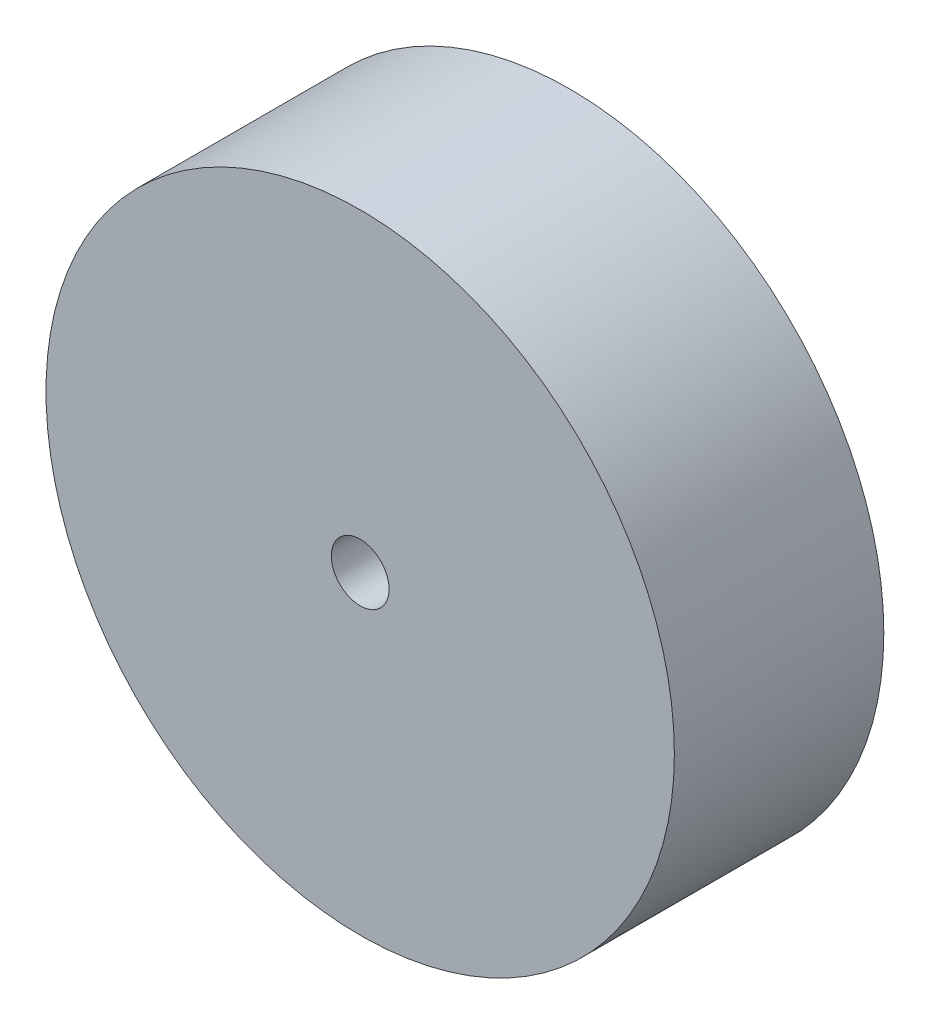
ISO-10303-21;
HEADER;
FILE_DESCRIPTION(('STEP AP214'),'2;1');
FILE_NAME('part.step','',(''),(''),'','','');
FILE_SCHEMA(('AUTOMOTIVE_DESIGN { 1 0 10303 214 1 1 1 1 }'));
ENDSEC;
DATA;
#1=APPLICATION_CONTEXT('core data for automotive mechanical design processes');
#2=APPLICATION_PROTOCOL_DEFINITION('international standard','automotive_design',2000,#1);
#3=PRODUCT_CONTEXT('',#1,'mechanical');
#4=PRODUCT('Part','Part','',(#3));
#5=PRODUCT_RELATED_PRODUCT_CATEGORY('part','',(#4));
#6=PRODUCT_DEFINITION_FORMATION('','',#4);
#7=PRODUCT_DEFINITION_CONTEXT('part definition',#1,'design');
#8=PRODUCT_DEFINITION('design','',#6,#7);
#9=PRODUCT_DEFINITION_SHAPE('','',#8);
#10=(LENGTH_UNIT() NAMED_UNIT(*) SI_UNIT(.MILLI.,.METRE.));
#11=(NAMED_UNIT(*) PLANE_ANGLE_UNIT() SI_UNIT($,.RADIAN.));
#12=(NAMED_UNIT(*) SI_UNIT($,.STERADIAN.) SOLID_ANGLE_UNIT());
#13=UNCERTAINTY_MEASURE_WITH_UNIT(LENGTH_MEASURE(1.E-05),#10,'distance_accuracy_value','');
#14=(GEOMETRIC_REPRESENTATION_CONTEXT(3) GLOBAL_UNCERTAINTY_ASSIGNED_CONTEXT((#13)) GLOBAL_UNIT_ASSIGNED_CONTEXT((#10,
#11,#12)) REPRESENTATION_CONTEXT('',''));
#15=CARTESIAN_POINT('',(0.,0.,0.));
#16=DIRECTION('',(0.,0.,1.));
#17=DIRECTION('',(1.,0.,0.));
#18=AXIS2_PLACEMENT_3D('',#15,#16,#17);
#19=CARTESIAN_POINT('',(0.,0.,12.7));
#20=DIRECTION('',(0.,0.,1.));
#21=DIRECTION('',(1.,0.,0.));
#22=AXIS2_PLACEMENT_3D('',#19,#20,#21);
#23=PLANE('',#22);
#24=CARTESIAN_POINT('',(0.,0.,12.7));
#25=DIRECTION('',(0.,0.,1.));
#26=DIRECTION('',(1.,0.,0.));
#27=AXIS2_PLACEMENT_3D('',#24,#25,#26);
#28=CIRCLE('',#27,19.05);
#29=CARTESIAN_POINT('',(19.05,0.,12.7));
#30=VERTEX_POINT('',#29);
#31=EDGE_CURVE('E10',#30,#30,#28,.T.);
#32=ORIENTED_EDGE('',*,*,#31,.T.);
#33=EDGE_LOOP('',(#32));
#34=FACE_BOUND('',#33,.T.);
#35=CARTESIAN_POINT('',(0.,0.,12.7));
#36=DIRECTION('',(0.,0.,1.));
#37=DIRECTION('',(1.,0.,0.));
#38=AXIS2_PLACEMENT_3D('',#35,#36,#37);
#39=CIRCLE('',#38,1.75);
#40=CARTESIAN_POINT('',(1.75,0.,12.7));
#41=VERTEX_POINT('',#40);
#42=EDGE_CURVE('E42',#41,#41,#39,.T.);
#43=ORIENTED_EDGE('',*,*,#42,.F.);
#44=EDGE_LOOP('',(#43));
#45=FACE_BOUND('',#44,.T.);
#46=ADVANCED_FACE('F31',(#34,#45),#23,.T.);
#47=CARTESIAN_POINT('',(0.,0.,0.));
#48=DIRECTION('',(0.,0.,1.));
#49=DIRECTION('',(1.,0.,0.));
#50=AXIS2_PLACEMENT_3D('',#47,#48,#49);
#51=PLANE('',#50);
#52=CARTESIAN_POINT('',(0.,0.,0.));
#53=DIRECTION('',(0.,0.,1.));
#54=DIRECTION('',(1.,0.,0.));
#55=AXIS2_PLACEMENT_3D('',#52,#53,#54);
#56=CIRCLE('',#55,19.05);
#57=CARTESIAN_POINT('',(19.05,0.,0.));
#58=VERTEX_POINT('',#57);
#59=EDGE_CURVE('E35',#58,#58,#56,.T.);
#60=ORIENTED_EDGE('',*,*,#59,.F.);
#61=EDGE_LOOP('',(#60));
#62=FACE_BOUND('',#61,.T.);
#63=CARTESIAN_POINT('',(0.,0.,0.));
#64=DIRECTION('',(0.,0.,1.));
#65=DIRECTION('',(1.,0.,0.));
#66=AXIS2_PLACEMENT_3D('',#63,#64,#65);
#67=CIRCLE('',#66,1.75);
#68=CARTESIAN_POINT('',(1.75,0.,0.));
#69=VERTEX_POINT('',#68);
#70=EDGE_CURVE('E44',#69,#69,#67,.T.);
#71=ORIENTED_EDGE('',*,*,#70,.T.);
#72=EDGE_LOOP('',(#71));
#73=FACE_BOUND('',#72,.T.);
#74=ADVANCED_FACE('F54',(#62,#73),#51,.F.);
#75=CARTESIAN_POINT('',(0.,0.,12.7));
#76=DIRECTION('',(0.,0.,-1.));
#77=DIRECTION('',(-1.,0.,0.));
#78=AXIS2_PLACEMENT_3D('',#75,#76,#77);
#79=CYLINDRICAL_SURFACE('',#78,19.05);
#80=ORIENTED_EDGE('',*,*,#31,.F.);
#81=EDGE_LOOP('',(#80));
#82=FACE_BOUND('',#81,.T.);
#83=ORIENTED_EDGE('',*,*,#59,.T.);
#84=EDGE_LOOP('',(#83));
#85=FACE_BOUND('',#84,.T.);
#86=ADVANCED_FACE('F33',(#82,#85),#79,.T.);
#87=CARTESIAN_POINT('',(0.,0.,12.7));
#88=DIRECTION('',(0.,0.,-1.));
#89=DIRECTION('',(-1.,0.,0.));
#90=AXIS2_PLACEMENT_3D('',#87,#88,#89);
#91=CYLINDRICAL_SURFACE('',#90,1.75);
#92=ORIENTED_EDGE('',*,*,#42,.T.);
#93=EDGE_LOOP('',(#92));
#94=FACE_BOUND('',#93,.T.);
#95=ORIENTED_EDGE('',*,*,#70,.F.);
#96=EDGE_LOOP('',(#95));
#97=FACE_BOUND('',#96,.T.);
#98=ADVANCED_FACE('F50',(#94,#97),#91,.F.);
#99=CLOSED_SHELL('',(#46,#74,#86,#98));
#100=MANIFOLD_SOLID_BREP('B2',#99);
#101=ADVANCED_BREP_SHAPE_REPRESENTATION('',(#18,#100),#14);
#102=SHAPE_DEFINITION_REPRESENTATION(#9,#101);
ENDSEC;
END-ISO-10303-21;
